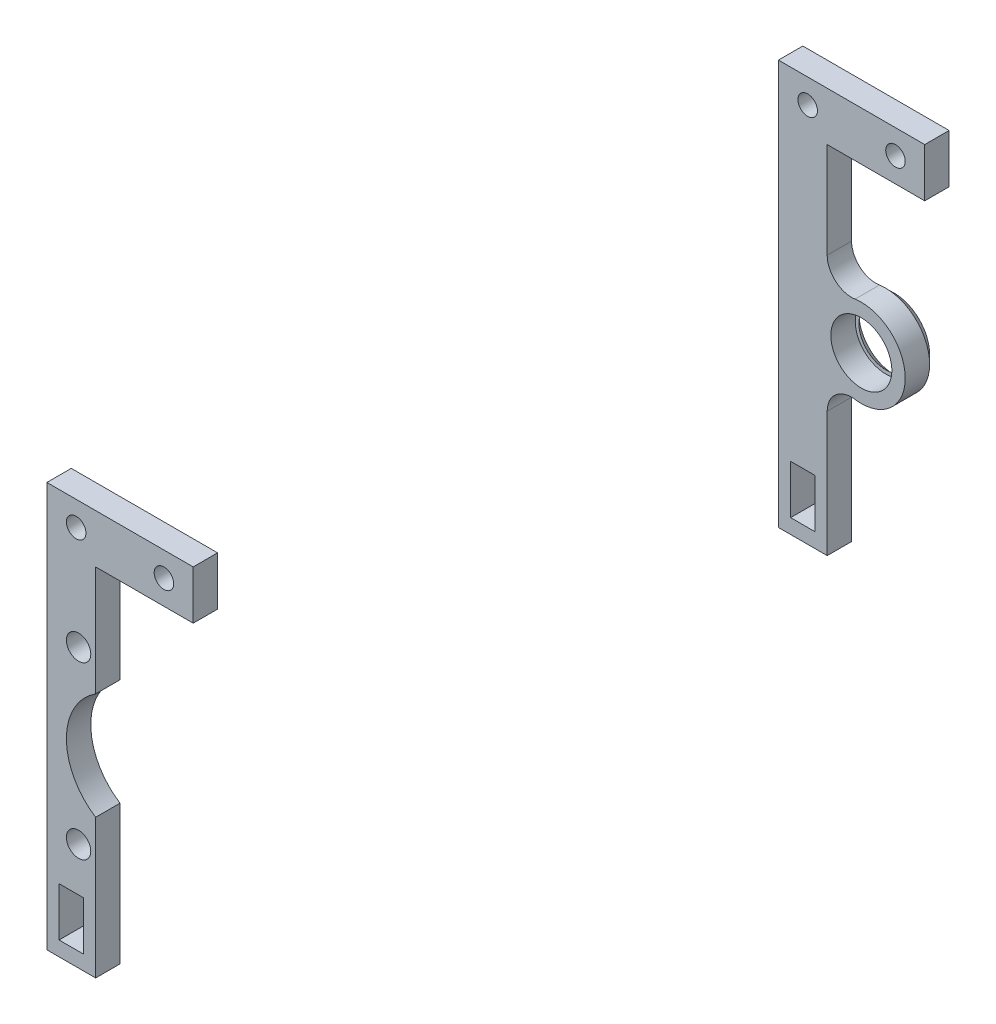
ISO-10303-21;
HEADER;
FILE_DESCRIPTION(('STEP AP214'),'2;1');
FILE_NAME('part.step','',(''),(''),'','','');
FILE_SCHEMA(('AUTOMOTIVE_DESIGN { 1 0 10303 214 1 1 1 1 }'));
ENDSEC;
DATA;
#1=APPLICATION_CONTEXT('core data for automotive mechanical design processes');
#2=APPLICATION_PROTOCOL_DEFINITION('international standard','automotive_design',2000,#1);
#3=PRODUCT_CONTEXT('',#1,'mechanical');
#4=PRODUCT('Part','Part','',(#3));
#5=PRODUCT_RELATED_PRODUCT_CATEGORY('part','',(#4));
#6=PRODUCT_DEFINITION_FORMATION('','',#4);
#7=PRODUCT_DEFINITION_CONTEXT('part definition',#1,'design');
#8=PRODUCT_DEFINITION('design','',#6,#7);
#9=PRODUCT_DEFINITION_SHAPE('','',#8);
#10=(LENGTH_UNIT() NAMED_UNIT(*) SI_UNIT(.MILLI.,.METRE.));
#11=(NAMED_UNIT(*) PLANE_ANGLE_UNIT() SI_UNIT($,.RADIAN.));
#12=(NAMED_UNIT(*) SI_UNIT($,.STERADIAN.) SOLID_ANGLE_UNIT());
#13=UNCERTAINTY_MEASURE_WITH_UNIT(LENGTH_MEASURE(1.E-05),#10,'distance_accuracy_value','');
#14=(GEOMETRIC_REPRESENTATION_CONTEXT(3) GLOBAL_UNCERTAINTY_ASSIGNED_CONTEXT((#13)) GLOBAL_UNIT_ASSIGNED_CONTEXT((#10,
#11,#12)) REPRESENTATION_CONTEXT('',''));
#15=CARTESIAN_POINT('',(0.,0.,0.));
#16=DIRECTION('',(0.,0.,1.));
#17=DIRECTION('',(1.,0.,0.));
#18=AXIS2_PLACEMENT_3D('',#15,#16,#17);
#19=CARTESIAN_POINT('',(5.,53.356406460551,-145.));
#20=DIRECTION('',(0.,0.,-1.));
#21=DIRECTION('',(-1.,0.,0.));
#22=AXIS2_PLACEMENT_3D('',#19,#20,#21);
#23=PLANE('',#22);
#24=DIRECTION('',(1.,0.,0.));
#25=VECTOR('',#24,1.);
#26=CARTESIAN_POINT('',(5.00000000000001,13.,-145.));
#27=LINE('',#26,#25);
#28=CARTESIAN_POINT('',(-7.5,13.,-145.));
#29=VERTEX_POINT('',#28);
#30=CARTESIAN_POINT('',(-2.5,13.,-145.));
#31=VERTEX_POINT('',#30);
#32=EDGE_CURVE('E272',#29,#31,#27,.T.);
#33=ORIENTED_EDGE('',*,*,#32,.T.);
#34=DIRECTION('',(0.,-1.,0.));
#35=VECTOR('',#34,1.);
#36=CARTESIAN_POINT('',(-2.5,53.356406460551,-145.));
#37=LINE('',#36,#35);
#38=CARTESIAN_POINT('',(-2.5,3.,-145.));
#39=VERTEX_POINT('',#38);
#40=EDGE_CURVE('E155',#31,#39,#37,.T.);
#41=ORIENTED_EDGE('',*,*,#40,.T.);
#42=DIRECTION('',(-1.,0.,0.));
#43=VECTOR('',#42,1.);
#44=CARTESIAN_POINT('',(5.,3.,-145.));
#45=LINE('',#44,#43);
#46=CARTESIAN_POINT('',(-7.5,3.,-145.));
#47=VERTEX_POINT('',#46);
#48=EDGE_CURVE('E266',#39,#47,#45,.T.);
#49=ORIENTED_EDGE('',*,*,#48,.T.);
#50=DIRECTION('',(0.,1.,0.));
#51=VECTOR('',#50,1.);
#52=CARTESIAN_POINT('',(-7.5,53.356406460551,-145.));
#53=LINE('',#52,#51);
#54=EDGE_CURVE('E269',#47,#29,#53,.T.);
#55=ORIENTED_EDGE('',*,*,#54,.T.);
#56=EDGE_LOOP('',(#33,#41,#49,#55));
#57=FACE_BOUND('',#56,.T.);
#58=DIRECTION('',(0.,1.,0.));
#59=VECTOR('',#58,1.);
#60=CARTESIAN_POINT('',(-10.,83.,-145.));
#61=LINE('',#60,#59);
#62=CARTESIAN_POINT('',(-10.,0.,-145.));
#63=VERTEX_POINT('',#62);
#64=CARTESIAN_POINT('',(-10.,83.,-145.));
#65=VERTEX_POINT('',#64);
#66=EDGE_CURVE('E169',#63,#65,#61,.T.);
#67=ORIENTED_EDGE('',*,*,#66,.F.);
#68=DIRECTION('',(-1.,0.,0.));
#69=VECTOR('',#68,1.);
#70=CARTESIAN_POINT('',(-10.,0.,-145.));
#71=LINE('',#70,#69);
#72=CARTESIAN_POINT('',(0.,0.,-145.));
#73=VERTEX_POINT('',#72);
#74=EDGE_CURVE('E218',#73,#63,#71,.T.);
#75=ORIENTED_EDGE('',*,*,#74,.F.);
#76=DIRECTION('',(0.,-1.,0.));
#77=VECTOR('',#76,1.);
#78=CARTESIAN_POINT('',(0.,0.,-145.));
#79=LINE('',#78,#77);
#80=CARTESIAN_POINT('',(0.,25.643593539449,-145.));
#81=VERTEX_POINT('',#80);
#82=EDGE_CURVE('E243',#81,#73,#79,.T.);
#83=ORIENTED_EDGE('',*,*,#82,.F.);
#84=CARTESIAN_POINT('',(5.,25.643593539449,-145.));
#85=DIRECTION('',(0.,0.,1.));
#86=DIRECTION('',(1.,0.,0.));
#87=AXIS2_PLACEMENT_3D('',#84,#85,#86);
#88=CIRCLE('',#87,5.);
#89=CARTESIAN_POINT('',(5.71428571428571,30.5923101325029,-145.));
#90=VERTEX_POINT('',#89);
#91=EDGE_CURVE('E240',#90,#81,#88,.T.);
#92=ORIENTED_EDGE('',*,*,#91,.F.);
#93=CARTESIAN_POINT('',(7.,39.5,-145.));
#94=DIRECTION('',(0.,0.,-1.));
#95=DIRECTION('',(-1.,0.,0.));
#96=AXIS2_PLACEMENT_3D('',#93,#94,#95);
#97=CIRCLE('',#96,9.00000000000001);
#98=CARTESIAN_POINT('',(5.71428571428571,48.4076898674971,-145.));
#99=VERTEX_POINT('',#98);
#100=EDGE_CURVE('E237',#99,#90,#97,.T.);
#101=ORIENTED_EDGE('',*,*,#100,.F.);
#102=CARTESIAN_POINT('',(5.,53.356406460551,-145.));
#103=DIRECTION('',(0.,0.,1.));
#104=DIRECTION('',(-1.,0.,0.));
#105=AXIS2_PLACEMENT_3D('',#102,#103,#104);
#106=CIRCLE('',#105,5.);
#107=CARTESIAN_POINT('',(0.,53.356406460551,-145.));
#108=VERTEX_POINT('',#107);
#109=EDGE_CURVE('E234',#108,#99,#106,.T.);
#110=ORIENTED_EDGE('',*,*,#109,.F.);
#111=DIRECTION('',(0.,-1.,0.));
#112=VECTOR('',#111,1.);
#113=CARTESIAN_POINT('',(0.,73.,-145.));
#114=LINE('',#113,#112);
#115=CARTESIAN_POINT('',(0.,73.,-145.));
#116=VERTEX_POINT('',#115);
#117=EDGE_CURVE('E231',#116,#108,#114,.T.);
#118=ORIENTED_EDGE('',*,*,#117,.F.);
#119=DIRECTION('',(-1.,0.,0.));
#120=VECTOR('',#119,1.);
#121=CARTESIAN_POINT('',(20.,73.,-145.));
#122=LINE('',#121,#120);
#123=CARTESIAN_POINT('',(20.,73.,-145.));
#124=VERTEX_POINT('',#123);
#125=EDGE_CURVE('E228',#124,#116,#122,.T.);
#126=ORIENTED_EDGE('',*,*,#125,.F.);
#127=DIRECTION('',(0.,-1.,0.));
#128=VECTOR('',#127,1.);
#129=CARTESIAN_POINT('',(20.,83.,-145.));
#130=LINE('',#129,#128);
#131=CARTESIAN_POINT('',(20.,83.,-145.));
#132=VERTEX_POINT('',#131);
#133=EDGE_CURVE('E225',#132,#124,#130,.T.);
#134=ORIENTED_EDGE('',*,*,#133,.F.);
#135=DIRECTION('',(1.,0.,0.));
#136=VECTOR('',#135,1.);
#137=CARTESIAN_POINT('',(0.,83.,-145.));
#138=LINE('',#137,#136);
#139=EDGE_CURVE('E186',#65,#132,#138,.T.);
#140=ORIENTED_EDGE('',*,*,#139,.F.);
#141=EDGE_LOOP('',(#67,#75,#83,#92,#101,#110,#118,#126,#134,#140));
#142=FACE_BOUND('',#141,.T.);
#143=CARTESIAN_POINT('',(7.,39.5,-145.));
#144=DIRECTION('',(0.,0.,-1.));
#145=DIRECTION('',(-1.,0.,0.));
#146=AXIS2_PLACEMENT_3D('',#143,#144,#145);
#147=CIRCLE('',#146,6.25);
#148=CARTESIAN_POINT('',(0.750000000000001,39.5,-145.));
#149=VERTEX_POINT('',#148);
#150=EDGE_CURVE('E193',#149,#149,#147,.T.);
#151=ORIENTED_EDGE('',*,*,#150,.T.);
#152=EDGE_LOOP('',(#151));
#153=FACE_BOUND('',#152,.T.);
#154=CARTESIAN_POINT('',(-4.,78.,-145.));
#155=DIRECTION('',(0.,0.,-1.));
#156=DIRECTION('',(-1.,0.,0.));
#157=AXIS2_PLACEMENT_3D('',#154,#155,#156);
#158=CIRCLE('',#157,2.);
#159=CARTESIAN_POINT('',(-6.00000000000001,78.,-145.));
#160=VERTEX_POINT('',#159);
#161=EDGE_CURVE('E187',#160,#160,#158,.T.);
#162=ORIENTED_EDGE('',*,*,#161,.T.);
#163=EDGE_LOOP('',(#162));
#164=FACE_BOUND('',#163,.T.);
#165=CARTESIAN_POINT('',(14.,78.,-145.));
#166=DIRECTION('',(0.,0.,-1.));
#167=DIRECTION('',(-1.,0.,0.));
#168=AXIS2_PLACEMENT_3D('',#165,#166,#167);
#169=CIRCLE('',#168,2.00000000000001);
#170=CARTESIAN_POINT('',(12.,78.,-145.));
#171=VERTEX_POINT('',#170);
#172=EDGE_CURVE('E183',#171,#171,#169,.T.);
#173=ORIENTED_EDGE('',*,*,#172,.T.);
#174=EDGE_LOOP('',(#173));
#175=FACE_BOUND('',#174,.T.);
#176=ADVANCED_FACE('F45',(#57,#142,#153,#164,#175),#23,.F.);
#177=CARTESIAN_POINT('',(-10.,0.,5.));
#178=DIRECTION('',(-1.,0.,0.));
#179=DIRECTION('',(0.,-1.,0.));
#180=AXIS2_PLACEMENT_3D('',#177,#178,#179);
#181=PLANE('',#180);
#182=DIRECTION('',(0.,0.,-1.));
#183=VECTOR('',#182,1.);
#184=CARTESIAN_POINT('',(-10.,0.,5.));
#185=LINE('',#184,#183);
#186=CARTESIAN_POINT('',(-10.,0.,-150.));
#187=VERTEX_POINT('',#186);
#188=EDGE_CURVE('E166',#63,#187,#185,.T.);
#189=ORIENTED_EDGE('',*,*,#188,.F.);
#190=ORIENTED_EDGE('',*,*,#66,.T.);
#191=DIRECTION('',(0.,0.,1.));
#192=VECTOR('',#191,1.);
#193=CARTESIAN_POINT('',(-10.,83.,-150.));
#194=LINE('',#193,#192);
#195=CARTESIAN_POINT('',(-10.,83.,-150.));
#196=VERTEX_POINT('',#195);
#197=EDGE_CURVE('E224',#196,#65,#194,.T.);
#198=ORIENTED_EDGE('',*,*,#197,.F.);
#199=DIRECTION('',(0.,1.,0.));
#200=VECTOR('',#199,1.);
#201=CARTESIAN_POINT('',(-10.,0.,-150.));
#202=LINE('',#201,#200);
#203=EDGE_CURVE('E200',#187,#196,#202,.T.);
#204=ORIENTED_EDGE('',*,*,#203,.F.);
#205=EDGE_LOOP('',(#189,#190,#198,#204));
#206=FACE_BOUND('',#205,.T.);
#207=ADVANCED_FACE('F47',(#206),#181,.T.);
#208=CARTESIAN_POINT('',(0.,0.,5.));
#209=DIRECTION('',(0.,-1.,0.));
#210=DIRECTION('',(0.,0.,-1.));
#211=AXIS2_PLACEMENT_3D('',#208,#209,#210);
#212=PLANE('',#211);
#213=ORIENTED_EDGE('',*,*,#74,.T.);
#214=ORIENTED_EDGE('',*,*,#188,.T.);
#215=DIRECTION('',(-1.,0.,0.));
#216=VECTOR('',#215,1.);
#217=CARTESIAN_POINT('',(-10.,0.,-150.));
#218=LINE('',#217,#216);
#219=CARTESIAN_POINT('',(0.,0.,-150.));
#220=VERTEX_POINT('',#219);
#221=EDGE_CURVE('E203',#220,#187,#218,.T.);
#222=ORIENTED_EDGE('',*,*,#221,.F.);
#223=DIRECTION('',(0.,0.,1.));
#224=VECTOR('',#223,1.);
#225=CARTESIAN_POINT('',(0.,0.,-150.));
#226=LINE('',#225,#224);
#227=EDGE_CURVE('E168',#220,#73,#226,.T.);
#228=ORIENTED_EDGE('',*,*,#227,.T.);
#229=EDGE_LOOP('',(#213,#214,#222,#228));
#230=FACE_BOUND('',#229,.T.);
#231=ADVANCED_FACE('F299',(#230),#212,.T.);
#232=CARTESIAN_POINT('',(5.,53.356406460551,-150.));
#233=DIRECTION('',(0.,0.,-1.));
#234=DIRECTION('',(-1.,0.,0.));
#235=AXIS2_PLACEMENT_3D('',#232,#233,#234);
#236=PLANE('',#235);
#237=DIRECTION('',(0.,-1.,0.));
#238=VECTOR('',#237,1.);
#239=CARTESIAN_POINT('',(-2.5,53.356406460551,-150.));
#240=LINE('',#239,#238);
#241=CARTESIAN_POINT('',(-2.5,13.,-150.));
#242=VERTEX_POINT('',#241);
#243=CARTESIAN_POINT('',(-2.5,3.,-150.));
#244=VERTEX_POINT('',#243);
#245=EDGE_CURVE('E12',#242,#244,#240,.T.);
#246=ORIENTED_EDGE('',*,*,#245,.F.);
#247=DIRECTION('',(1.,0.,0.));
#248=VECTOR('',#247,1.);
#249=CARTESIAN_POINT('',(5.00000000000001,13.,-150.));
#250=LINE('',#249,#248);
#251=CARTESIAN_POINT('',(-7.5,13.,-150.));
#252=VERTEX_POINT('',#251);
#253=EDGE_CURVE('E142',#252,#242,#250,.T.);
#254=ORIENTED_EDGE('',*,*,#253,.F.);
#255=DIRECTION('',(0.,1.,0.));
#256=VECTOR('',#255,1.);
#257=CARTESIAN_POINT('',(-7.5,53.356406460551,-150.));
#258=LINE('',#257,#256);
#259=CARTESIAN_POINT('',(-7.5,3.,-150.));
#260=VERTEX_POINT('',#259);
#261=EDGE_CURVE('E147',#260,#252,#258,.T.);
#262=ORIENTED_EDGE('',*,*,#261,.F.);
#263=DIRECTION('',(-1.,0.,0.));
#264=VECTOR('',#263,1.);
#265=CARTESIAN_POINT('',(5.,3.,-150.));
#266=LINE('',#265,#264);
#267=EDGE_CURVE('E53',#244,#260,#266,.T.);
#268=ORIENTED_EDGE('',*,*,#267,.F.);
#269=EDGE_LOOP('',(#246,#254,#262,#268));
#270=FACE_BOUND('',#269,.T.);
#271=CARTESIAN_POINT('',(7.,39.5,-150.));
#272=DIRECTION('',(0.,0.,-1.));
#273=DIRECTION('',(-1.,0.,0.));
#274=AXIS2_PLACEMENT_3D('',#271,#272,#273);
#275=CIRCLE('',#274,9.);
#276=CARTESIAN_POINT('',(5.71428571428571,30.5923101325029,-150.));
#277=VERTEX_POINT('',#276);
#278=CARTESIAN_POINT('',(5.71428571428571,48.4076898674971,-150.));
#279=VERTEX_POINT('',#278);
#280=EDGE_CURVE('E173',#277,#279,#275,.T.);
#281=ORIENTED_EDGE('',*,*,#280,.F.);
#282=CARTESIAN_POINT('',(5.,25.643593539449,-150.));
#283=DIRECTION('',(0.,0.,1.));
#284=DIRECTION('',(1.,0.,0.));
#285=AXIS2_PLACEMENT_3D('',#282,#283,#284);
#286=CIRCLE('',#285,5.);
#287=CARTESIAN_POINT('',(0.,25.643593539449,-150.));
#288=VERTEX_POINT('',#287);
#289=EDGE_CURVE('E215',#277,#288,#286,.T.);
#290=ORIENTED_EDGE('',*,*,#289,.T.);
#291=DIRECTION('',(0.,-1.,0.));
#292=VECTOR('',#291,1.);
#293=CARTESIAN_POINT('',(0.,0.,-150.));
#294=LINE('',#293,#292);
#295=EDGE_CURVE('E217',#288,#220,#294,.T.);
#296=ORIENTED_EDGE('',*,*,#295,.T.);
#297=ORIENTED_EDGE('',*,*,#221,.T.);
#298=ORIENTED_EDGE('',*,*,#203,.T.);
#299=DIRECTION('',(1.,0.,0.));
#300=VECTOR('',#299,1.);
#301=CARTESIAN_POINT('',(-10.,83.,-150.));
#302=LINE('',#301,#300);
#303=CARTESIAN_POINT('',(20.,83.,-150.));
#304=VERTEX_POINT('',#303);
#305=EDGE_CURVE('E202',#196,#304,#302,.T.);
#306=ORIENTED_EDGE('',*,*,#305,.T.);
#307=DIRECTION('',(0.,-1.,0.));
#308=VECTOR('',#307,1.);
#309=CARTESIAN_POINT('',(20.,83.,-150.));
#310=LINE('',#309,#308);
#311=CARTESIAN_POINT('',(20.,73.,-150.));
#312=VERTEX_POINT('',#311);
#313=EDGE_CURVE('E205',#304,#312,#310,.T.);
#314=ORIENTED_EDGE('',*,*,#313,.T.);
#315=DIRECTION('',(-1.,0.,0.));
#316=VECTOR('',#315,1.);
#317=CARTESIAN_POINT('',(20.,73.,-150.));
#318=LINE('',#317,#316);
#319=CARTESIAN_POINT('',(0.,73.,-150.));
#320=VERTEX_POINT('',#319);
#321=EDGE_CURVE('E207',#312,#320,#318,.T.);
#322=ORIENTED_EDGE('',*,*,#321,.T.);
#323=DIRECTION('',(0.,-1.,0.));
#324=VECTOR('',#323,1.);
#325=CARTESIAN_POINT('',(0.,73.,-150.));
#326=LINE('',#325,#324);
#327=CARTESIAN_POINT('',(0.,53.356406460551,-150.));
#328=VERTEX_POINT('',#327);
#329=EDGE_CURVE('E209',#320,#328,#326,.T.);
#330=ORIENTED_EDGE('',*,*,#329,.T.);
#331=CARTESIAN_POINT('',(5.,53.356406460551,-150.));
#332=DIRECTION('',(0.,0.,1.));
#333=DIRECTION('',(-1.,0.,0.));
#334=AXIS2_PLACEMENT_3D('',#331,#332,#333);
#335=CIRCLE('',#334,5.);
#336=EDGE_CURVE('E199',#328,#279,#335,.T.);
#337=ORIENTED_EDGE('',*,*,#336,.T.);
#338=EDGE_LOOP('',(#281,#290,#296,#297,#298,#306,#314,#322,#330,#337));
#339=FACE_BOUND('',#338,.T.);
#340=CARTESIAN_POINT('',(-4.,78.,-150.));
#341=DIRECTION('',(0.,0.,-1.));
#342=DIRECTION('',(-1.,0.,0.));
#343=AXIS2_PLACEMENT_3D('',#340,#341,#342);
#344=CIRCLE('',#343,2.);
#345=CARTESIAN_POINT('',(-6.00000000000001,78.,-150.));
#346=VERTEX_POINT('',#345);
#347=EDGE_CURVE('E182',#346,#346,#344,.T.);
#348=ORIENTED_EDGE('',*,*,#347,.F.);
#349=EDGE_LOOP('',(#348));
#350=FACE_BOUND('',#349,.T.);
#351=CARTESIAN_POINT('',(14.,78.,-150.));
#352=DIRECTION('',(0.,0.,-1.));
#353=DIRECTION('',(-1.,0.,0.));
#354=AXIS2_PLACEMENT_3D('',#351,#352,#353);
#355=CIRCLE('',#354,2.00000000000001);
#356=CARTESIAN_POINT('',(12.,78.,-150.));
#357=VERTEX_POINT('',#356);
#358=EDGE_CURVE('E179',#357,#357,#355,.T.);
#359=ORIENTED_EDGE('',*,*,#358,.F.);
#360=EDGE_LOOP('',(#359));
#361=FACE_BOUND('',#360,.T.);
#362=ADVANCED_FACE('F159',(#270,#339,#350,#361),#236,.T.);
#363=CARTESIAN_POINT('',(0.,83.,-150.));
#364=DIRECTION('',(0.,-1.,0.));
#365=DIRECTION('',(0.,0.,-1.));
#366=AXIS2_PLACEMENT_3D('',#363,#364,#365);
#367=PLANE('',#366);
#368=ORIENTED_EDGE('',*,*,#139,.T.);
#369=DIRECTION('',(0.,0.,1.));
#370=VECTOR('',#369,1.);
#371=CARTESIAN_POINT('',(20.,83.,-150.));
#372=LINE('',#371,#370);
#373=EDGE_CURVE('E227',#304,#132,#372,.T.);
#374=ORIENTED_EDGE('',*,*,#373,.F.);
#375=ORIENTED_EDGE('',*,*,#305,.F.);
#376=ORIENTED_EDGE('',*,*,#197,.T.);
#377=EDGE_LOOP('',(#368,#374,#375,#376));
#378=FACE_BOUND('',#377,.T.);
#379=ADVANCED_FACE('F306',(#378),#367,.F.);
#380=CARTESIAN_POINT('',(20.,83.,-150.));
#381=DIRECTION('',(-1.,0.,0.));
#382=DIRECTION('',(0.,-1.,0.));
#383=AXIS2_PLACEMENT_3D('',#380,#381,#382);
#384=PLANE('',#383);
#385=ORIENTED_EDGE('',*,*,#133,.T.);
#386=DIRECTION('',(0.,0.,1.));
#387=VECTOR('',#386,1.);
#388=CARTESIAN_POINT('',(20.,73.,-150.));
#389=LINE('',#388,#387);
#390=EDGE_CURVE('E230',#312,#124,#389,.T.);
#391=ORIENTED_EDGE('',*,*,#390,.F.);
#392=ORIENTED_EDGE('',*,*,#313,.F.);
#393=ORIENTED_EDGE('',*,*,#373,.T.);
#394=EDGE_LOOP('',(#385,#391,#392,#393));
#395=FACE_BOUND('',#394,.T.);
#396=ADVANCED_FACE('F380',(#395),#384,.F.);
#397=CARTESIAN_POINT('',(20.,73.,-150.));
#398=DIRECTION('',(0.,1.,0.));
#399=DIRECTION('',(0.,0.,1.));
#400=AXIS2_PLACEMENT_3D('',#397,#398,#399);
#401=PLANE('',#400);
#402=ORIENTED_EDGE('',*,*,#125,.T.);
#403=DIRECTION('',(0.,0.,1.));
#404=VECTOR('',#403,1.);
#405=CARTESIAN_POINT('',(0.,73.,-150.));
#406=LINE('',#405,#404);
#407=EDGE_CURVE('E233',#320,#116,#406,.T.);
#408=ORIENTED_EDGE('',*,*,#407,.F.);
#409=ORIENTED_EDGE('',*,*,#321,.F.);
#410=ORIENTED_EDGE('',*,*,#390,.T.);
#411=EDGE_LOOP('',(#402,#408,#409,#410));
#412=FACE_BOUND('',#411,.T.);
#413=ADVANCED_FACE('F376',(#412),#401,.F.);
#414=CARTESIAN_POINT('',(0.,73.,-150.));
#415=DIRECTION('',(-1.,0.,0.));
#416=DIRECTION('',(0.,0.,1.));
#417=AXIS2_PLACEMENT_3D('',#414,#415,#416);
#418=PLANE('',#417);
#419=ORIENTED_EDGE('',*,*,#117,.T.);
#420=DIRECTION('',(0.,0.,1.));
#421=VECTOR('',#420,1.);
#422=CARTESIAN_POINT('',(0.,53.356406460551,-150.));
#423=LINE('',#422,#421);
#424=EDGE_CURVE('E236',#328,#108,#423,.T.);
#425=ORIENTED_EDGE('',*,*,#424,.F.);
#426=ORIENTED_EDGE('',*,*,#329,.F.);
#427=ORIENTED_EDGE('',*,*,#407,.T.);
#428=EDGE_LOOP('',(#419,#425,#426,#427));
#429=FACE_BOUND('',#428,.T.);
#430=ADVANCED_FACE('F371',(#429),#418,.F.);
#431=CARTESIAN_POINT('',(5.,53.356406460551,-150.));
#432=DIRECTION('',(0.,0.,1.));
#433=DIRECTION('',(1.,0.,0.));
#434=AXIS2_PLACEMENT_3D('',#431,#432,#433);
#435=CYLINDRICAL_SURFACE('',#434,5.);
#436=ORIENTED_EDGE('',*,*,#109,.T.);
#437=DIRECTION('',(0.,0.,1.));
#438=VECTOR('',#437,1.);
#439=CARTESIAN_POINT('',(5.71428571428571,48.4076898674971,-150.));
#440=LINE('',#439,#438);
#441=EDGE_CURVE('E239',#279,#99,#440,.T.);
#442=ORIENTED_EDGE('',*,*,#441,.F.);
#443=ORIENTED_EDGE('',*,*,#336,.F.);
#444=ORIENTED_EDGE('',*,*,#424,.T.);
#445=EDGE_LOOP('',(#436,#442,#443,#444));
#446=FACE_BOUND('',#445,.T.);
#447=ADVANCED_FACE('F360',(#446),#435,.F.);
#448=CARTESIAN_POINT('',(7.,39.5,-150.));
#449=DIRECTION('',(0.,0.,1.));
#450=DIRECTION('',(1.,0.,0.));
#451=AXIS2_PLACEMENT_3D('',#448,#449,#450);
#452=CYLINDRICAL_SURFACE('',#451,9.00000000000001);
#453=ORIENTED_EDGE('',*,*,#100,.T.);
#454=DIRECTION('',(0.,0.,1.));
#455=VECTOR('',#454,1.);
#456=CARTESIAN_POINT('',(5.71428571428571,30.5923101325029,-150.));
#457=LINE('',#456,#455);
#458=EDGE_CURVE('E242',#277,#90,#457,.T.);
#459=ORIENTED_EDGE('',*,*,#458,.F.);
#460=CARTESIAN_POINT('',(7.,39.5,-150.));
#461=DIRECTION('',(0.,0.,-1.));
#462=DIRECTION('',(-1.,0.,0.));
#463=AXIS2_PLACEMENT_3D('',#460,#461,#462);
#464=CIRCLE('',#463,9.00000000000001);
#465=EDGE_CURVE('E176',#279,#277,#464,.T.);
#466=ORIENTED_EDGE('',*,*,#465,.F.);
#467=ORIENTED_EDGE('',*,*,#441,.T.);
#468=EDGE_LOOP('',(#453,#459,#466,#467));
#469=FACE_BOUND('',#468,.T.);
#470=ADVANCED_FACE('F356',(#469),#452,.T.);
#471=CARTESIAN_POINT('',(5.,25.643593539449,-150.));
#472=DIRECTION('',(0.,0.,1.));
#473=DIRECTION('',(1.,0.,0.));
#474=AXIS2_PLACEMENT_3D('',#471,#472,#473);
#475=CYLINDRICAL_SURFACE('',#474,5.);
#476=ORIENTED_EDGE('',*,*,#91,.T.);
#477=DIRECTION('',(0.,0.,1.));
#478=VECTOR('',#477,1.);
#479=CARTESIAN_POINT('',(0.,25.643593539449,-150.));
#480=LINE('',#479,#478);
#481=EDGE_CURVE('E196',#288,#81,#480,.T.);
#482=ORIENTED_EDGE('',*,*,#481,.F.);
#483=ORIENTED_EDGE('',*,*,#289,.F.);
#484=ORIENTED_EDGE('',*,*,#458,.T.);
#485=EDGE_LOOP('',(#476,#482,#483,#484));
#486=FACE_BOUND('',#485,.T.);
#487=ADVANCED_FACE('F353',(#486),#475,.F.);
#488=CARTESIAN_POINT('',(0.,0.,-150.));
#489=DIRECTION('',(-1.,0.,0.));
#490=DIRECTION('',(0.,0.,1.));
#491=AXIS2_PLACEMENT_3D('',#488,#489,#490);
#492=PLANE('',#491);
#493=ORIENTED_EDGE('',*,*,#82,.T.);
#494=ORIENTED_EDGE('',*,*,#227,.F.);
#495=ORIENTED_EDGE('',*,*,#295,.F.);
#496=ORIENTED_EDGE('',*,*,#481,.T.);
#497=EDGE_LOOP('',(#493,#494,#495,#496));
#498=FACE_BOUND('',#497,.T.);
#499=ADVANCED_FACE('F303',(#498),#492,.F.);
#500=CARTESIAN_POINT('',(7.,39.5,-150.));
#501=DIRECTION('',(0.,0.,1.));
#502=DIRECTION('',(1.,0.,0.));
#503=AXIS2_PLACEMENT_3D('',#500,#501,#502);
#504=CYLINDRICAL_SURFACE('',#503,6.25);
#505=CARTESIAN_POINT('',(7.,39.5,-150.));
#506=DIRECTION('',(0.,0.,-1.));
#507=DIRECTION('',(-1.,0.,0.));
#508=AXIS2_PLACEMENT_3D('',#505,#506,#507);
#509=CIRCLE('',#508,6.25);
#510=CARTESIAN_POINT('',(0.750000000000001,39.5,-150.));
#511=VERTEX_POINT('',#510);
#512=EDGE_CURVE('E190',#511,#511,#509,.T.);
#513=ORIENTED_EDGE('',*,*,#512,.T.);
#514=EDGE_LOOP('',(#513));
#515=FACE_BOUND('',#514,.T.);
#516=ORIENTED_EDGE('',*,*,#150,.F.);
#517=EDGE_LOOP('',(#516));
#518=FACE_BOUND('',#517,.T.);
#519=ADVANCED_FACE('F307',(#515,#518),#504,.F.);
#520=CARTESIAN_POINT('',(-4.,78.,-150.));
#521=DIRECTION('',(0.,0.,1.));
#522=DIRECTION('',(1.,0.,0.));
#523=AXIS2_PLACEMENT_3D('',#520,#521,#522);
#524=CYLINDRICAL_SURFACE('',#523,2.);
#525=ORIENTED_EDGE('',*,*,#347,.T.);
#526=EDGE_LOOP('',(#525));
#527=FACE_BOUND('',#526,.T.);
#528=ORIENTED_EDGE('',*,*,#161,.F.);
#529=EDGE_LOOP('',(#528));
#530=FACE_BOUND('',#529,.T.);
#531=ADVANCED_FACE('F310',(#527,#530),#524,.F.);
#532=CARTESIAN_POINT('',(14.,78.,-150.));
#533=DIRECTION('',(0.,0.,1.));
#534=DIRECTION('',(1.,0.,0.));
#535=AXIS2_PLACEMENT_3D('',#532,#533,#534);
#536=CYLINDRICAL_SURFACE('',#535,2.00000000000001);
#537=ORIENTED_EDGE('',*,*,#358,.T.);
#538=EDGE_LOOP('',(#537));
#539=FACE_BOUND('',#538,.T.);
#540=ORIENTED_EDGE('',*,*,#172,.F.);
#541=EDGE_LOOP('',(#540));
#542=FACE_BOUND('',#541,.T.);
#543=ADVANCED_FACE('F314',(#539,#542),#536,.F.);
#544=CARTESIAN_POINT('',(7.,39.5,-150.));
#545=DIRECTION('',(0.,0.,1.));
#546=DIRECTION('',(-1.,0.,0.));
#547=AXIS2_PLACEMENT_3D('',#544,#545,#546);
#548=CONICAL_SURFACE('',#547,9.,0.785398163397449);
#549=ORIENTED_EDGE('',*,*,#465,.T.);
#550=ORIENTED_EDGE('',*,*,#280,.T.);
#551=EDGE_LOOP('',(#549,#550));
#552=FACE_BOUND('',#551,.T.);
#553=CARTESIAN_POINT('',(7.,39.5,-151.75));
#554=DIRECTION('',(0.,0.,1.));
#555=DIRECTION('',(1.,0.,0.));
#556=AXIS2_PLACEMENT_3D('',#553,#554,#555);
#557=CIRCLE('',#556,7.24999999999999);
#558=CARTESIAN_POINT('',(14.25,39.5,-151.75));
#559=VERTEX_POINT('',#558);
#560=EDGE_CURVE('E172',#559,#559,#557,.T.);
#561=ORIENTED_EDGE('',*,*,#560,.T.);
#562=EDGE_LOOP('',(#561));
#563=FACE_BOUND('',#562,.T.);
#564=ADVANCED_FACE('F318',(#552,#563),#548,.T.);
#565=CARTESIAN_POINT('',(7.,39.5,-150.));
#566=DIRECTION('',(0.,0.,-1.));
#567=DIRECTION('',(-1.,0.,0.));
#568=AXIS2_PLACEMENT_3D('',#565,#566,#567);
#569=PLANE('',#568);
#570=ORIENTED_EDGE('',*,*,#512,.F.);
#571=EDGE_LOOP('',(#570));
#572=FACE_BOUND('',#571,.T.);
#573=CARTESIAN_POINT('',(7.,39.5,-150.));
#574=DIRECTION('',(0.,0.,-1.));
#575=DIRECTION('',(-1.,0.,0.));
#576=AXIS2_PLACEMENT_3D('',#573,#574,#575);
#577=CIRCLE('',#576,5.5);
#578=CARTESIAN_POINT('',(1.5,39.5,-150.));
#579=VERTEX_POINT('',#578);
#580=EDGE_CURVE('E148',#579,#579,#577,.T.);
#581=ORIENTED_EDGE('',*,*,#580,.T.);
#582=EDGE_LOOP('',(#581));
#583=FACE_BOUND('',#582,.T.);
#584=ADVANCED_FACE('F321',(#572,#583),#569,.F.);
#585=CARTESIAN_POINT('',(7.,39.5,-150.));
#586=DIRECTION('',(0.,0.,-1.));
#587=DIRECTION('',(-1.,0.,0.));
#588=AXIS2_PLACEMENT_3D('',#585,#586,#587);
#589=CONICAL_SURFACE('',#588,5.5,0.785398163397449);
#590=ORIENTED_EDGE('',*,*,#560,.F.);
#591=EDGE_LOOP('',(#590));
#592=FACE_BOUND('',#591,.T.);
#593=ORIENTED_EDGE('',*,*,#580,.F.);
#594=EDGE_LOOP('',(#593));
#595=FACE_BOUND('',#594,.T.);
#596=ADVANCED_FACE('F290',(#592,#595),#589,.F.);
#597=CARTESIAN_POINT('',(-2.5,3.,-151.75));
#598=DIRECTION('',(1.,0.,0.));
#599=DIRECTION('',(0.,0.,-1.));
#600=AXIS2_PLACEMENT_3D('',#597,#598,#599);
#601=PLANE('',#600);
#602=DIRECTION('',(0.,0.,1.));
#603=VECTOR('',#602,1.);
#604=CARTESIAN_POINT('',(-2.5,13.,-151.75));
#605=LINE('',#604,#603);
#606=EDGE_CURVE('E60',#242,#31,#605,.T.);
#607=ORIENTED_EDGE('',*,*,#606,.F.);
#608=ORIENTED_EDGE('',*,*,#245,.T.);
#609=DIRECTION('',(0.,0.,1.));
#610=VECTOR('',#609,1.);
#611=CARTESIAN_POINT('',(-2.5,3.,-151.75));
#612=LINE('',#611,#610);
#613=EDGE_CURVE('E273',#244,#39,#612,.T.);
#614=ORIENTED_EDGE('',*,*,#613,.T.);
#615=ORIENTED_EDGE('',*,*,#40,.F.);
#616=EDGE_LOOP('',(#607,#608,#614,#615));
#617=FACE_BOUND('',#616,.T.);
#618=ADVANCED_FACE('F151',(#617),#601,.F.);
#619=CARTESIAN_POINT('',(-7.5,3.,-151.75));
#620=DIRECTION('',(0.,-1.,0.));
#621=DIRECTION('',(0.,0.,-1.));
#622=AXIS2_PLACEMENT_3D('',#619,#620,#621);
#623=PLANE('',#622);
#624=ORIENTED_EDGE('',*,*,#613,.F.);
#625=ORIENTED_EDGE('',*,*,#267,.T.);
#626=DIRECTION('',(0.,0.,1.));
#627=VECTOR('',#626,1.);
#628=CARTESIAN_POINT('',(-7.5,3.,-151.75));
#629=LINE('',#628,#627);
#630=EDGE_CURVE('E276',#260,#47,#629,.T.);
#631=ORIENTED_EDGE('',*,*,#630,.T.);
#632=ORIENTED_EDGE('',*,*,#48,.F.);
#633=EDGE_LOOP('',(#624,#625,#631,#632));
#634=FACE_BOUND('',#633,.T.);
#635=ADVANCED_FACE('F282',(#634),#623,.F.);
#636=CARTESIAN_POINT('',(-7.5,3.,-151.75));
#637=DIRECTION('',(-1.,0.,0.));
#638=DIRECTION('',(0.,0.,1.));
#639=AXIS2_PLACEMENT_3D('',#636,#637,#638);
#640=PLANE('',#639);
#641=ORIENTED_EDGE('',*,*,#630,.F.);
#642=ORIENTED_EDGE('',*,*,#261,.T.);
#643=DIRECTION('',(0.,0.,1.));
#644=VECTOR('',#643,1.);
#645=CARTESIAN_POINT('',(-7.5,13.,-151.75));
#646=LINE('',#645,#644);
#647=EDGE_CURVE('E65',#252,#29,#646,.T.);
#648=ORIENTED_EDGE('',*,*,#647,.T.);
#649=ORIENTED_EDGE('',*,*,#54,.F.);
#650=EDGE_LOOP('',(#641,#642,#648,#649));
#651=FACE_BOUND('',#650,.T.);
#652=ADVANCED_FACE('F281',(#651),#640,.F.);
#653=CARTESIAN_POINT('',(-7.5,13.,-151.75));
#654=DIRECTION('',(0.,1.,0.));
#655=DIRECTION('',(-1.,0.,0.));
#656=AXIS2_PLACEMENT_3D('',#653,#654,#655);
#657=PLANE('',#656);
#658=ORIENTED_EDGE('',*,*,#647,.F.);
#659=ORIENTED_EDGE('',*,*,#253,.T.);
#660=ORIENTED_EDGE('',*,*,#606,.T.);
#661=ORIENTED_EDGE('',*,*,#32,.F.);
#662=EDGE_LOOP('',(#658,#659,#660,#661));
#663=FACE_BOUND('',#662,.T.);
#664=ADVANCED_FACE('F143',(#663),#657,.F.);
#665=CLOSED_SHELL('',(#176,#207,#231,#362,#379,#396,#413,#430,#447,#470,#487,#499,#519,#531,
#543,#564,#584,#596,#618,#635,#652,#664));
#666=MANIFOLD_SOLID_BREP('B2',#665);
#667=CARTESIAN_POINT('',(0.,0.,5.));
#668=DIRECTION('',(0.,0.,1.));
#669=DIRECTION('',(1.,0.,0.));
#670=AXIS2_PLACEMENT_3D('',#667,#668,#669);
#671=PLANE('',#670);
#672=DIRECTION('',(0.,1.,0.));
#673=VECTOR('',#672,1.);
#674=CARTESIAN_POINT('',(-2.5,3.,5.));
#675=LINE('',#674,#673);
#676=CARTESIAN_POINT('',(-2.5,3.,5.));
#677=VERTEX_POINT('',#676);
#678=CARTESIAN_POINT('',(-2.5,13.,5.));
#679=VERTEX_POINT('',#678);
#680=EDGE_CURVE('E574',#677,#679,#675,.T.);
#681=ORIENTED_EDGE('',*,*,#680,.F.);
#682=DIRECTION('',(1.,0.,0.));
#683=VECTOR('',#682,1.);
#684=CARTESIAN_POINT('',(-7.5,3.,5.));
#685=LINE('',#684,#683);
#686=CARTESIAN_POINT('',(-7.5,3.,5.));
#687=VERTEX_POINT('',#686);
#688=EDGE_CURVE('E666',#687,#677,#685,.T.);
#689=ORIENTED_EDGE('',*,*,#688,.F.);
#690=DIRECTION('',(0.,-1.,0.));
#691=VECTOR('',#690,1.);
#692=CARTESIAN_POINT('',(-7.5,3.,5.));
#693=LINE('',#692,#691);
#694=CARTESIAN_POINT('',(-7.5,13.,5.));
#695=VERTEX_POINT('',#694);
#696=EDGE_CURVE('E651',#695,#687,#693,.T.);
#697=ORIENTED_EDGE('',*,*,#696,.F.);
#698=DIRECTION('',(-1.,0.,0.));
#699=VECTOR('',#698,1.);
#700=CARTESIAN_POINT('',(-7.5,13.,5.));
#701=LINE('',#700,#699);
#702=EDGE_CURVE('E660',#679,#695,#701,.T.);
#703=ORIENTED_EDGE('',*,*,#702,.F.);
#704=EDGE_LOOP('',(#681,#689,#697,#703));
#705=FACE_BOUND('',#704,.T.);
#706=CARTESIAN_POINT('',(-4.,78.,5.));
#707=DIRECTION('',(0.,0.,1.));
#708=DIRECTION('',(1.,0.,0.));
#709=AXIS2_PLACEMENT_3D('',#706,#707,#708);
#710=CIRCLE('',#709,2.);
#711=CARTESIAN_POINT('',(-2.,78.,5.));
#712=VERTEX_POINT('',#711);
#713=EDGE_CURVE('E676',#712,#712,#710,.T.);
#714=ORIENTED_EDGE('',*,*,#713,.F.);
#715=EDGE_LOOP('',(#714));
#716=FACE_BOUND('',#715,.T.);
#717=CARTESIAN_POINT('',(14.,78.,5.));
#718=DIRECTION('',(0.,0.,1.));
#719=DIRECTION('',(1.,0.,0.));
#720=AXIS2_PLACEMENT_3D('',#717,#718,#719);
#721=CIRCLE('',#720,2.00000000000001);
#722=CARTESIAN_POINT('',(16.,78.,5.));
#723=VERTEX_POINT('',#722);
#724=EDGE_CURVE('E679',#723,#723,#721,.T.);
#725=ORIENTED_EDGE('',*,*,#724,.F.);
#726=EDGE_LOOP('',(#725));
#727=FACE_BOUND('',#726,.T.);
#728=CARTESIAN_POINT('',(-3.5,22.,5.));
#729=DIRECTION('',(0.,0.,1.));
#730=DIRECTION('',(1.,0.,0.));
#731=AXIS2_PLACEMENT_3D('',#728,#729,#730);
#732=CIRCLE('',#731,2.5);
#733=CARTESIAN_POINT('',(-0.999999999999997,22.,5.));
#734=VERTEX_POINT('',#733);
#735=EDGE_CURVE('E683',#734,#734,#732,.F.);
#736=ORIENTED_EDGE('',*,*,#735,.T.);
#737=EDGE_LOOP('',(#736));
#738=FACE_BOUND('',#737,.T.);
#739=CARTESIAN_POINT('',(-3.5,57.,5.));
#740=DIRECTION('',(0.,0.,1.));
#741=DIRECTION('',(1.,0.,0.));
#742=AXIS2_PLACEMENT_3D('',#739,#740,#741);
#743=CIRCLE('',#742,2.5);
#744=CARTESIAN_POINT('',(-0.999999999999997,57.,5.));
#745=VERTEX_POINT('',#744);
#746=EDGE_CURVE('E686',#745,#745,#743,.T.);
#747=ORIENTED_EDGE('',*,*,#746,.F.);
#748=EDGE_LOOP('',(#747));
#749=FACE_BOUND('',#748,.T.);
#750=DIRECTION('',(0.,1.,0.));
#751=VECTOR('',#750,1.);
#752=CARTESIAN_POINT('',(0.,0.,5.));
#753=LINE('',#752,#751);
#754=CARTESIAN_POINT('',(0.,0.,5.));
#755=VERTEX_POINT('',#754);
#756=CARTESIAN_POINT('',(0.,28.5455488498967,5.));
#757=VERTEX_POINT('',#756);
#758=EDGE_CURVE('E689',#755,#757,#753,.T.);
#759=ORIENTED_EDGE('',*,*,#758,.T.);
#760=CARTESIAN_POINT('',(7.,39.5,5.));
#761=DIRECTION('',(0.,0.,1.));
#762=DIRECTION('',(1.,0.,0.));
#763=AXIS2_PLACEMENT_3D('',#760,#761,#762);
#764=CIRCLE('',#763,13.);
#765=CARTESIAN_POINT('',(0.,50.4544511501033,5.));
#766=VERTEX_POINT('',#765);
#767=EDGE_CURVE('E692',#757,#766,#764,.F.);
#768=ORIENTED_EDGE('',*,*,#767,.T.);
#769=DIRECTION('',(0.,1.,0.));
#770=VECTOR('',#769,1.);
#771=CARTESIAN_POINT('',(0.,0.,5.));
#772=LINE('',#771,#770);
#773=CARTESIAN_POINT('',(0.,73.,5.));
#774=VERTEX_POINT('',#773);
#775=EDGE_CURVE('E694',#766,#774,#772,.T.);
#776=ORIENTED_EDGE('',*,*,#775,.T.);
#777=DIRECTION('',(-1.,0.,0.));
#778=VECTOR('',#777,1.);
#779=CARTESIAN_POINT('',(0.,73.,5.));
#780=LINE('',#779,#778);
#781=CARTESIAN_POINT('',(20.,73.,5.));
#782=VERTEX_POINT('',#781);
#783=EDGE_CURVE('E696',#782,#774,#780,.T.);
#784=ORIENTED_EDGE('',*,*,#783,.F.);
#785=DIRECTION('',(0.,-1.,0.));
#786=VECTOR('',#785,1.);
#787=CARTESIAN_POINT('',(20.,0.,5.));
#788=LINE('',#787,#786);
#789=CARTESIAN_POINT('',(20.,83.,5.));
#790=VERTEX_POINT('',#789);
#791=EDGE_CURVE('E699',#790,#782,#788,.T.);
#792=ORIENTED_EDGE('',*,*,#791,.F.);
#793=DIRECTION('',(1.,0.,0.));
#794=VECTOR('',#793,1.);
#795=CARTESIAN_POINT('',(0.,83.,5.));
#796=LINE('',#795,#794);
#797=CARTESIAN_POINT('',(-10.,83.,5.));
#798=VERTEX_POINT('',#797);
#799=EDGE_CURVE('E702',#798,#790,#796,.T.);
#800=ORIENTED_EDGE('',*,*,#799,.F.);
#801=DIRECTION('',(0.,1.,0.));
#802=VECTOR('',#801,1.);
#803=CARTESIAN_POINT('',(-10.,0.,5.));
#804=LINE('',#803,#802);
#805=CARTESIAN_POINT('',(-10.,0.,5.));
#806=VERTEX_POINT('',#805);
#807=EDGE_CURVE('E705',#806,#798,#804,.T.);
#808=ORIENTED_EDGE('',*,*,#807,.F.);
#809=DIRECTION('',(-1.,0.,0.));
#810=VECTOR('',#809,1.);
#811=CARTESIAN_POINT('',(0.,0.,5.));
#812=LINE('',#811,#810);
#813=EDGE_CURVE('E708',#755,#806,#812,.T.);
#814=ORIENTED_EDGE('',*,*,#813,.F.);
#815=EDGE_LOOP('',(#759,#768,#776,#784,#792,#800,#808,#814));
#816=FACE_BOUND('',#815,.T.);
#817=ADVANCED_FACE('F559',(#705,#716,#727,#738,#749,#816),#671,.T.);
#818=CARTESIAN_POINT('',(-3.5,57.,5.));
#819=DIRECTION('',(0.,0.,-1.));
#820=DIRECTION('',(-1.,0.,0.));
#821=AXIS2_PLACEMENT_3D('',#818,#819,#820);
#822=CYLINDRICAL_SURFACE('',#821,2.5);
#823=ORIENTED_EDGE('',*,*,#746,.T.);
#824=EDGE_LOOP('',(#823));
#825=FACE_BOUND('',#824,.T.);
#826=CARTESIAN_POINT('',(-3.5,57.,0.));
#827=DIRECTION('',(0.,0.,1.));
#828=DIRECTION('',(1.,0.,0.));
#829=AXIS2_PLACEMENT_3D('',#826,#827,#828);
#830=CIRCLE('',#829,2.5);
#831=CARTESIAN_POINT('',(-0.999999999999997,57.,0.));
#832=VERTEX_POINT('',#831);
#833=EDGE_CURVE('E720',#832,#832,#830,.T.);
#834=ORIENTED_EDGE('',*,*,#833,.F.);
#835=EDGE_LOOP('',(#834));
#836=FACE_BOUND('',#835,.T.);
#837=ADVANCED_FACE('F788',(#825,#836),#822,.F.);
#838=CARTESIAN_POINT('',(-3.5,22.,5.));
#839=DIRECTION('',(0.,0.,-1.));
#840=DIRECTION('',(-1.,0.,0.));
#841=AXIS2_PLACEMENT_3D('',#838,#839,#840);
#842=CYLINDRICAL_SURFACE('',#841,2.5);
#843=ORIENTED_EDGE('',*,*,#735,.F.);
#844=EDGE_LOOP('',(#843));
#845=FACE_BOUND('',#844,.T.);
#846=CARTESIAN_POINT('',(-3.5,22.,0.));
#847=DIRECTION('',(0.,0.,1.));
#848=DIRECTION('',(1.,0.,0.));
#849=AXIS2_PLACEMENT_3D('',#846,#847,#848);
#850=CIRCLE('',#849,2.5);
#851=CARTESIAN_POINT('',(-0.999999999999997,22.,0.));
#852=VERTEX_POINT('',#851);
#853=EDGE_CURVE('E717',#852,#852,#850,.F.);
#854=ORIENTED_EDGE('',*,*,#853,.T.);
#855=EDGE_LOOP('',(#854));
#856=FACE_BOUND('',#855,.T.);
#857=ADVANCED_FACE('F793',(#845,#856),#842,.F.);
#858=CARTESIAN_POINT('',(0.,0.,5.));
#859=DIRECTION('',(-1.,0.,0.));
#860=DIRECTION('',(0.,0.,1.));
#861=AXIS2_PLACEMENT_3D('',#858,#859,#860);
#862=PLANE('',#861);
#863=DIRECTION('',(0.,1.,0.));
#864=VECTOR('',#863,1.);
#865=CARTESIAN_POINT('',(0.,0.,0.));
#866=LINE('',#865,#864);
#867=CARTESIAN_POINT('',(0.,0.,0.));
#868=VERTEX_POINT('',#867);
#869=CARTESIAN_POINT('',(0.,28.5455488498967,0.));
#870=VERTEX_POINT('',#869);
#871=EDGE_CURVE('E723',#868,#870,#866,.T.);
#872=ORIENTED_EDGE('',*,*,#871,.T.);
#873=DIRECTION('',(0.,0.,-1.));
#874=VECTOR('',#873,1.);
#875=CARTESIAN_POINT('',(0.,28.5455488498967,5.));
#876=LINE('',#875,#874);
#877=EDGE_CURVE('E760',#757,#870,#876,.T.);
#878=ORIENTED_EDGE('',*,*,#877,.F.);
#879=ORIENTED_EDGE('',*,*,#758,.F.);
#880=DIRECTION('',(0.,0.,-1.));
#881=VECTOR('',#880,1.);
#882=CARTESIAN_POINT('',(0.,0.,5.));
#883=LINE('',#882,#881);
#884=EDGE_CURVE('E711',#755,#868,#883,.T.);
#885=ORIENTED_EDGE('',*,*,#884,.T.);
#886=EDGE_LOOP('',(#872,#878,#879,#885));
#887=FACE_BOUND('',#886,.T.);
#888=ADVANCED_FACE('F821',(#887),#862,.F.);
#889=CARTESIAN_POINT('',(7.,39.5,5.));
#890=DIRECTION('',(0.,0.,-1.));
#891=DIRECTION('',(-1.,0.,0.));
#892=AXIS2_PLACEMENT_3D('',#889,#890,#891);
#893=CYLINDRICAL_SURFACE('',#892,13.);
#894=CARTESIAN_POINT('',(7.,39.5,0.));
#895=DIRECTION('',(0.,0.,1.));
#896=DIRECTION('',(1.,0.,0.));
#897=AXIS2_PLACEMENT_3D('',#894,#895,#896);
#898=CIRCLE('',#897,13.);
#899=CARTESIAN_POINT('',(0.,50.4544511501033,0.));
#900=VERTEX_POINT('',#899);
#901=EDGE_CURVE('E726',#870,#900,#898,.F.);
#902=ORIENTED_EDGE('',*,*,#901,.T.);
#903=DIRECTION('',(0.,0.,-1.));
#904=VECTOR('',#903,1.);
#905=CARTESIAN_POINT('',(0.,50.4544511501033,5.));
#906=LINE('',#905,#904);
#907=EDGE_CURVE('E757',#766,#900,#906,.T.);
#908=ORIENTED_EDGE('',*,*,#907,.F.);
#909=ORIENTED_EDGE('',*,*,#767,.F.);
#910=ORIENTED_EDGE('',*,*,#877,.T.);
#911=EDGE_LOOP('',(#902,#908,#909,#910));
#912=FACE_BOUND('',#911,.T.);
#913=ADVANCED_FACE('F817',(#912),#893,.F.);
#914=CARTESIAN_POINT('',(0.,0.,5.));
#915=DIRECTION('',(-1.,0.,0.));
#916=DIRECTION('',(0.,-1.,0.));
#917=AXIS2_PLACEMENT_3D('',#914,#915,#916);
#918=PLANE('',#917);
#919=DIRECTION('',(0.,1.,0.));
#920=VECTOR('',#919,1.);
#921=CARTESIAN_POINT('',(0.,0.,0.));
#922=LINE('',#921,#920);
#923=CARTESIAN_POINT('',(0.,73.,0.));
#924=VERTEX_POINT('',#923);
#925=EDGE_CURVE('E728',#900,#924,#922,.T.);
#926=ORIENTED_EDGE('',*,*,#925,.T.);
#927=DIRECTION('',(0.,0.,-1.));
#928=VECTOR('',#927,1.);
#929=CARTESIAN_POINT('',(0.,73.,5.));
#930=LINE('',#929,#928);
#931=EDGE_CURVE('E755',#774,#924,#930,.T.);
#932=ORIENTED_EDGE('',*,*,#931,.F.);
#933=ORIENTED_EDGE('',*,*,#775,.F.);
#934=ORIENTED_EDGE('',*,*,#907,.T.);
#935=EDGE_LOOP('',(#926,#932,#933,#934));
#936=FACE_BOUND('',#935,.T.);
#937=ADVANCED_FACE('F813',(#936),#918,.F.);
#938=CARTESIAN_POINT('',(0.,73.,5.));
#939=DIRECTION('',(0.,-1.,0.));
#940=DIRECTION('',(0.,0.,-1.));
#941=AXIS2_PLACEMENT_3D('',#938,#939,#940);
#942=PLANE('',#941);
#943=DIRECTION('',(-1.,0.,0.));
#944=VECTOR('',#943,1.);
#945=CARTESIAN_POINT('',(0.,73.,0.));
#946=LINE('',#945,#944);
#947=CARTESIAN_POINT('',(20.,73.,0.));
#948=VERTEX_POINT('',#947);
#949=EDGE_CURVE('E731',#948,#924,#946,.T.);
#950=ORIENTED_EDGE('',*,*,#949,.F.);
#951=DIRECTION('',(0.,0.,-1.));
#952=VECTOR('',#951,1.);
#953=CARTESIAN_POINT('',(20.,73.,5.));
#954=LINE('',#953,#952);
#955=EDGE_CURVE('E753',#782,#948,#954,.T.);
#956=ORIENTED_EDGE('',*,*,#955,.F.);
#957=ORIENTED_EDGE('',*,*,#783,.T.);
#958=ORIENTED_EDGE('',*,*,#931,.T.);
#959=EDGE_LOOP('',(#950,#956,#957,#958));
#960=FACE_BOUND('',#959,.T.);
#961=ADVANCED_FACE('F809',(#960),#942,.T.);
#962=CARTESIAN_POINT('',(20.,0.,5.));
#963=DIRECTION('',(1.,0.,0.));
#964=DIRECTION('',(0.,1.,0.));
#965=AXIS2_PLACEMENT_3D('',#962,#963,#964);
#966=PLANE('',#965);
#967=DIRECTION('',(0.,-1.,0.));
#968=VECTOR('',#967,1.);
#969=CARTESIAN_POINT('',(20.,0.,0.));
#970=LINE('',#969,#968);
#971=CARTESIAN_POINT('',(20.,83.,0.));
#972=VERTEX_POINT('',#971);
#973=EDGE_CURVE('E734',#972,#948,#970,.T.);
#974=ORIENTED_EDGE('',*,*,#973,.F.);
#975=DIRECTION('',(0.,0.,-1.));
#976=VECTOR('',#975,1.);
#977=CARTESIAN_POINT('',(20.,83.,5.));
#978=LINE('',#977,#976);
#979=EDGE_CURVE('E751',#790,#972,#978,.T.);
#980=ORIENTED_EDGE('',*,*,#979,.F.);
#981=ORIENTED_EDGE('',*,*,#791,.T.);
#982=ORIENTED_EDGE('',*,*,#955,.T.);
#983=EDGE_LOOP('',(#974,#980,#981,#982));
#984=FACE_BOUND('',#983,.T.);
#985=ADVANCED_FACE('F805',(#984),#966,.T.);
#986=CARTESIAN_POINT('',(0.,83.,5.));
#987=DIRECTION('',(0.,1.,0.));
#988=DIRECTION('',(0.,0.,1.));
#989=AXIS2_PLACEMENT_3D('',#986,#987,#988);
#990=PLANE('',#989);
#991=DIRECTION('',(1.,0.,0.));
#992=VECTOR('',#991,1.);
#993=CARTESIAN_POINT('',(0.,83.,0.));
#994=LINE('',#993,#992);
#995=CARTESIAN_POINT('',(-10.,83.,0.));
#996=VERTEX_POINT('',#995);
#997=EDGE_CURVE('E737',#996,#972,#994,.T.);
#998=ORIENTED_EDGE('',*,*,#997,.F.);
#999=DIRECTION('',(0.,0.,-1.));
#1000=VECTOR('',#999,1.);
#1001=CARTESIAN_POINT('',(-10.,83.,5.));
#1002=LINE('',#1001,#1000);
#1003=EDGE_CURVE('E748',#798,#996,#1002,.T.);
#1004=ORIENTED_EDGE('',*,*,#1003,.F.);
#1005=ORIENTED_EDGE('',*,*,#799,.T.);
#1006=ORIENTED_EDGE('',*,*,#979,.T.);
#1007=EDGE_LOOP('',(#998,#1004,#1005,#1006));
#1008=FACE_BOUND('',#1007,.T.);
#1009=ADVANCED_FACE('F801',(#1008),#990,.T.);
#1010=CARTESIAN_POINT('',(14.,78.,5.));
#1011=DIRECTION('',(0.,0.,-1.));
#1012=DIRECTION('',(-1.,0.,0.));
#1013=AXIS2_PLACEMENT_3D('',#1010,#1011,#1012);
#1014=CYLINDRICAL_SURFACE('',#1013,2.00000000000001);
#1015=ORIENTED_EDGE('',*,*,#724,.T.);
#1016=EDGE_LOOP('',(#1015));
#1017=FACE_BOUND('',#1016,.T.);
#1018=CARTESIAN_POINT('',(14.,78.,0.));
#1019=DIRECTION('',(0.,0.,1.));
#1020=DIRECTION('',(1.,0.,0.));
#1021=AXIS2_PLACEMENT_3D('',#1018,#1019,#1020);
#1022=CIRCLE('',#1021,2.00000000000001);
#1023=CARTESIAN_POINT('',(16.,78.,0.));
#1024=VERTEX_POINT('',#1023);
#1025=EDGE_CURVE('E714',#1024,#1024,#1022,.T.);
#1026=ORIENTED_EDGE('',*,*,#1025,.F.);
#1027=EDGE_LOOP('',(#1026));
#1028=FACE_BOUND('',#1027,.T.);
#1029=ADVANCED_FACE('F804',(#1017,#1028),#1014,.F.);
#1030=CARTESIAN_POINT('',(-4.,78.,5.));
#1031=DIRECTION('',(0.,0.,-1.));
#1032=DIRECTION('',(-1.,0.,0.));
#1033=AXIS2_PLACEMENT_3D('',#1030,#1031,#1032);
#1034=CYLINDRICAL_SURFACE('',#1033,2.);
#1035=ORIENTED_EDGE('',*,*,#713,.T.);
#1036=EDGE_LOOP('',(#1035));
#1037=FACE_BOUND('',#1036,.T.);
#1038=CARTESIAN_POINT('',(-4.,78.,0.));
#1039=DIRECTION('',(0.,0.,1.));
#1040=DIRECTION('',(1.,0.,0.));
#1041=AXIS2_PLACEMENT_3D('',#1038,#1039,#1040);
#1042=CIRCLE('',#1041,2.);
#1043=CARTESIAN_POINT('',(-2.,78.,0.));
#1044=VERTEX_POINT('',#1043);
#1045=EDGE_CURVE('E673',#1044,#1044,#1042,.T.);
#1046=ORIENTED_EDGE('',*,*,#1045,.F.);
#1047=EDGE_LOOP('',(#1046));
#1048=FACE_BOUND('',#1047,.T.);
#1049=ADVANCED_FACE('F561',(#1037,#1048),#1034,.F.);
#1050=CARTESIAN_POINT('',(0.,0.,0.));
#1051=DIRECTION('',(0.,0.,1.));
#1052=DIRECTION('',(1.,0.,0.));
#1053=AXIS2_PLACEMENT_3D('',#1050,#1051,#1052);
#1054=PLANE('',#1053);
#1055=DIRECTION('',(1.,0.,0.));
#1056=VECTOR('',#1055,1.);
#1057=CARTESIAN_POINT('',(0.,3.,0.));
#1058=LINE('',#1057,#1056);
#1059=CARTESIAN_POINT('',(-7.5,3.,0.));
#1060=VERTEX_POINT('',#1059);
#1061=CARTESIAN_POINT('',(-2.5,3.,0.));
#1062=VERTEX_POINT('',#1061);
#1063=EDGE_CURVE('E567',#1060,#1062,#1058,.T.);
#1064=ORIENTED_EDGE('',*,*,#1063,.T.);
#1065=DIRECTION('',(0.,1.,0.));
#1066=VECTOR('',#1065,1.);
#1067=CARTESIAN_POINT('',(-2.5,0.,0.));
#1068=LINE('',#1067,#1066);
#1069=CARTESIAN_POINT('',(-2.5,13.,0.));
#1070=VERTEX_POINT('',#1069);
#1071=EDGE_CURVE('E43',#1062,#1070,#1068,.T.);
#1072=ORIENTED_EDGE('',*,*,#1071,.T.);
#1073=DIRECTION('',(-1.,0.,0.));
#1074=VECTOR('',#1073,1.);
#1075=CARTESIAN_POINT('',(0.,13.,0.));
#1076=LINE('',#1075,#1074);
#1077=CARTESIAN_POINT('',(-7.5,13.,0.));
#1078=VERTEX_POINT('',#1077);
#1079=EDGE_CURVE('E763',#1070,#1078,#1076,.T.);
#1080=ORIENTED_EDGE('',*,*,#1079,.T.);
#1081=DIRECTION('',(0.,-1.,0.));
#1082=VECTOR('',#1081,1.);
#1083=CARTESIAN_POINT('',(-7.5,0.,0.));
#1084=LINE('',#1083,#1082);
#1085=EDGE_CURVE('E654',#1078,#1060,#1084,.T.);
#1086=ORIENTED_EDGE('',*,*,#1085,.T.);
#1087=EDGE_LOOP('',(#1064,#1072,#1080,#1086));
#1088=FACE_BOUND('',#1087,.T.);
#1089=DIRECTION('',(0.,1.,0.));
#1090=VECTOR('',#1089,1.);
#1091=CARTESIAN_POINT('',(-10.,0.,0.));
#1092=LINE('',#1091,#1090);
#1093=CARTESIAN_POINT('',(-10.,0.,0.));
#1094=VERTEX_POINT('',#1093);
#1095=EDGE_CURVE('E740',#1094,#996,#1092,.T.);
#1096=ORIENTED_EDGE('',*,*,#1095,.T.);
#1097=ORIENTED_EDGE('',*,*,#997,.T.);
#1098=ORIENTED_EDGE('',*,*,#973,.T.);
#1099=ORIENTED_EDGE('',*,*,#949,.T.);
#1100=ORIENTED_EDGE('',*,*,#925,.F.);
#1101=ORIENTED_EDGE('',*,*,#901,.F.);
#1102=ORIENTED_EDGE('',*,*,#871,.F.);
#1103=DIRECTION('',(-1.,0.,0.));
#1104=VECTOR('',#1103,1.);
#1105=CARTESIAN_POINT('',(0.,0.,0.));
#1106=LINE('',#1105,#1104);
#1107=EDGE_CURVE('E680',#868,#1094,#1106,.T.);
#1108=ORIENTED_EDGE('',*,*,#1107,.T.);
#1109=EDGE_LOOP('',(#1096,#1097,#1098,#1099,#1100,#1101,#1102,#1108));
#1110=FACE_BOUND('',#1109,.T.);
#1111=ORIENTED_EDGE('',*,*,#853,.F.);
#1112=EDGE_LOOP('',(#1111));
#1113=FACE_BOUND('',#1112,.T.);
#1114=ORIENTED_EDGE('',*,*,#1045,.T.);
#1115=EDGE_LOOP('',(#1114));
#1116=FACE_BOUND('',#1115,.T.);
#1117=ORIENTED_EDGE('',*,*,#1025,.T.);
#1118=EDGE_LOOP('',(#1117));
#1119=FACE_BOUND('',#1118,.T.);
#1120=ORIENTED_EDGE('',*,*,#833,.T.);
#1121=EDGE_LOOP('',(#1120));
#1122=FACE_BOUND('',#1121,.T.);
#1123=ADVANCED_FACE('F767',(#1088,#1110,#1113,#1116,#1119,#1122),#1054,.F.);
#1124=CARTESIAN_POINT('',(0.,0.,5.));
#1125=DIRECTION('',(0.,-1.,0.));
#1126=DIRECTION('',(0.,0.,-1.));
#1127=AXIS2_PLACEMENT_3D('',#1124,#1125,#1126);
#1128=PLANE('',#1127);
#1129=DIRECTION('',(0.,0.,-1.));
#1130=VECTOR('',#1129,1.);
#1131=CARTESIAN_POINT('',(-10.,0.,5.));
#1132=LINE('',#1131,#1130);
#1133=EDGE_CURVE('E745',#806,#1094,#1132,.T.);
#1134=ORIENTED_EDGE('',*,*,#1133,.T.);
#1135=ORIENTED_EDGE('',*,*,#1107,.F.);
#1136=ORIENTED_EDGE('',*,*,#884,.F.);
#1137=ORIENTED_EDGE('',*,*,#813,.T.);
#1138=EDGE_LOOP('',(#1134,#1135,#1136,#1137));
#1139=FACE_BOUND('',#1138,.T.);
#1140=ADVANCED_FACE('F782',(#1139),#1128,.T.);
#1141=CARTESIAN_POINT('',(-10.,0.,5.));
#1142=DIRECTION('',(-1.,0.,0.));
#1143=DIRECTION('',(0.,-1.,0.));
#1144=AXIS2_PLACEMENT_3D('',#1141,#1142,#1143);
#1145=PLANE('',#1144);
#1146=ORIENTED_EDGE('',*,*,#1095,.F.);
#1147=ORIENTED_EDGE('',*,*,#1133,.F.);
#1148=ORIENTED_EDGE('',*,*,#807,.T.);
#1149=ORIENTED_EDGE('',*,*,#1003,.T.);
#1150=EDGE_LOOP('',(#1146,#1147,#1148,#1149));
#1151=FACE_BOUND('',#1150,.T.);
#1152=ADVANCED_FACE('F774',(#1151),#1145,.T.);
#1153=CARTESIAN_POINT('',(-2.5,3.,-151.75));
#1154=DIRECTION('',(1.,0.,0.));
#1155=DIRECTION('',(0.,0.,-1.));
#1156=AXIS2_PLACEMENT_3D('',#1153,#1154,#1155);
#1157=PLANE('',#1156);
#1158=DIRECTION('',(0.,0.,1.));
#1159=VECTOR('',#1158,1.);
#1160=CARTESIAN_POINT('',(-2.5,3.,-151.75));
#1161=LINE('',#1160,#1159);
#1162=EDGE_CURVE('E671',#1062,#677,#1161,.T.);
#1163=ORIENTED_EDGE('',*,*,#1162,.T.);
#1164=ORIENTED_EDGE('',*,*,#680,.T.);
#1165=DIRECTION('',(0.,0.,1.));
#1166=VECTOR('',#1165,1.);
#1167=CARTESIAN_POINT('',(-2.5,13.,-151.75));
#1168=LINE('',#1167,#1166);
#1169=EDGE_CURVE('E657',#1070,#679,#1168,.T.);
#1170=ORIENTED_EDGE('',*,*,#1169,.F.);
#1171=ORIENTED_EDGE('',*,*,#1071,.F.);
#1172=EDGE_LOOP('',(#1163,#1164,#1170,#1171));
#1173=FACE_BOUND('',#1172,.T.);
#1174=ADVANCED_FACE('F772',(#1173),#1157,.F.);
#1175=CARTESIAN_POINT('',(-7.5,3.,-151.75));
#1176=DIRECTION('',(0.,-1.,0.));
#1177=DIRECTION('',(0.,0.,-1.));
#1178=AXIS2_PLACEMENT_3D('',#1175,#1176,#1177);
#1179=PLANE('',#1178);
#1180=DIRECTION('',(0.,0.,1.));
#1181=VECTOR('',#1180,1.);
#1182=CARTESIAN_POINT('',(-7.5,3.,-151.75));
#1183=LINE('',#1182,#1181);
#1184=EDGE_CURVE('E656',#1060,#687,#1183,.T.);
#1185=ORIENTED_EDGE('',*,*,#1184,.T.);
#1186=ORIENTED_EDGE('',*,*,#688,.T.);
#1187=ORIENTED_EDGE('',*,*,#1162,.F.);
#1188=ORIENTED_EDGE('',*,*,#1063,.F.);
#1189=EDGE_LOOP('',(#1185,#1186,#1187,#1188));
#1190=FACE_BOUND('',#1189,.T.);
#1191=ADVANCED_FACE('F771',(#1190),#1179,.F.);
#1192=CARTESIAN_POINT('',(-7.5,3.,-151.75));
#1193=DIRECTION('',(-1.,0.,0.));
#1194=DIRECTION('',(0.,0.,1.));
#1195=AXIS2_PLACEMENT_3D('',#1192,#1193,#1194);
#1196=PLANE('',#1195);
#1197=DIRECTION('',(0.,0.,1.));
#1198=VECTOR('',#1197,1.);
#1199=CARTESIAN_POINT('',(-7.5,13.,-151.75));
#1200=LINE('',#1199,#1198);
#1201=EDGE_CURVE('E582',#1078,#695,#1200,.T.);
#1202=ORIENTED_EDGE('',*,*,#1201,.T.);
#1203=ORIENTED_EDGE('',*,*,#696,.T.);
#1204=ORIENTED_EDGE('',*,*,#1184,.F.);
#1205=ORIENTED_EDGE('',*,*,#1085,.F.);
#1206=EDGE_LOOP('',(#1202,#1203,#1204,#1205));
#1207=FACE_BOUND('',#1206,.T.);
#1208=ADVANCED_FACE('F648',(#1207),#1196,.F.);
#1209=CARTESIAN_POINT('',(-7.5,13.,-151.75));
#1210=DIRECTION('',(0.,1.,0.));
#1211=DIRECTION('',(-1.,0.,0.));
#1212=AXIS2_PLACEMENT_3D('',#1209,#1210,#1211);
#1213=PLANE('',#1212);
#1214=ORIENTED_EDGE('',*,*,#1169,.T.);
#1215=ORIENTED_EDGE('',*,*,#702,.T.);
#1216=ORIENTED_EDGE('',*,*,#1201,.F.);
#1217=ORIENTED_EDGE('',*,*,#1079,.F.);
#1218=EDGE_LOOP('',(#1214,#1215,#1216,#1217));
#1219=FACE_BOUND('',#1218,.T.);
#1220=ADVANCED_FACE('F661',(#1219),#1213,.F.);
#1221=CLOSED_SHELL('',(#817,#837,#857,#888,#913,#937,#961,#985,#1009,#1029,#1049,#1123,#1140,
#1152,#1174,#1191,#1208,#1220));
#1222=MANIFOLD_SOLID_BREP('B6',#1221);
#1223=ADVANCED_BREP_SHAPE_REPRESENTATION('',(#18,#666,#1222),#14);
#1224=SHAPE_DEFINITION_REPRESENTATION(#9,#1223);
ENDSEC;
END-ISO-10303-21;
